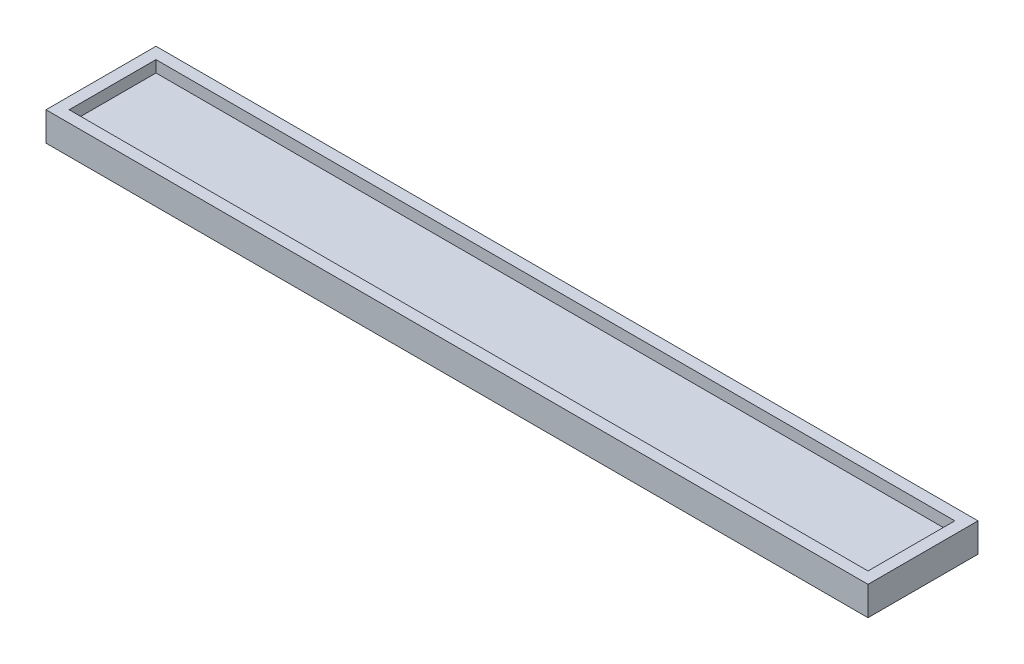
ISO-10303-21;
HEADER;
FILE_DESCRIPTION(('STEP AP214'),'2;1');
FILE_NAME('part.step','',(''),(''),'','','');
FILE_SCHEMA(('AUTOMOTIVE_DESIGN { 1 0 10303 214 1 1 1 1 }'));
ENDSEC;
DATA;
#1=APPLICATION_CONTEXT('core data for automotive mechanical design processes');
#2=APPLICATION_PROTOCOL_DEFINITION('international standard','automotive_design',2000,#1);
#3=PRODUCT_CONTEXT('',#1,'mechanical');
#4=PRODUCT('Part','Part','',(#3));
#5=PRODUCT_RELATED_PRODUCT_CATEGORY('part','',(#4));
#6=PRODUCT_DEFINITION_FORMATION('','',#4);
#7=PRODUCT_DEFINITION_CONTEXT('part definition',#1,'design');
#8=PRODUCT_DEFINITION('design','',#6,#7);
#9=PRODUCT_DEFINITION_SHAPE('','',#8);
#10=(LENGTH_UNIT() NAMED_UNIT(*) SI_UNIT(.MILLI.,.METRE.));
#11=(NAMED_UNIT(*) PLANE_ANGLE_UNIT() SI_UNIT($,.RADIAN.));
#12=(NAMED_UNIT(*) SI_UNIT($,.STERADIAN.) SOLID_ANGLE_UNIT());
#13=UNCERTAINTY_MEASURE_WITH_UNIT(LENGTH_MEASURE(1.E-05),#10,'distance_accuracy_value','');
#14=(GEOMETRIC_REPRESENTATION_CONTEXT(3) GLOBAL_UNCERTAINTY_ASSIGNED_CONTEXT((#13)) GLOBAL_UNIT_ASSIGNED_CONTEXT((#10,
#11,#12)) REPRESENTATION_CONTEXT('',''));
#15=CARTESIAN_POINT('',(0.,0.,0.));
#16=DIRECTION('',(0.,0.,1.));
#17=DIRECTION('',(1.,0.,0.));
#18=AXIS2_PLACEMENT_3D('',#15,#16,#17);
#19=CARTESIAN_POINT('',(0.,3.,0.));
#20=DIRECTION('',(0.,-1.,0.));
#21=DIRECTION('',(0.,0.,-1.));
#22=AXIS2_PLACEMENT_3D('',#19,#20,#21);
#23=PLANE('',#22);
#24=DIRECTION('',(0.,0.,1.));
#25=VECTOR('',#24,1.);
#26=CARTESIAN_POINT('',(0.,3.,0.));
#27=LINE('',#26,#25);
#28=CARTESIAN_POINT('',(0.,3.,-15.));
#29=VERTEX_POINT('',#28);
#30=CARTESIAN_POINT('',(0.,3.,0.));
#31=VERTEX_POINT('',#30);
#32=EDGE_CURVE('E160',#29,#31,#27,.T.);
#33=ORIENTED_EDGE('',*,*,#32,.T.);
#34=DIRECTION('',(1.,0.,0.));
#35=VECTOR('',#34,1.);
#36=CARTESIAN_POINT('',(0.,3.,0.));
#37=LINE('',#36,#35);
#38=CARTESIAN_POINT('',(138.,3.,0.));
#39=VERTEX_POINT('',#38);
#40=EDGE_CURVE('E164',#31,#39,#37,.T.);
#41=ORIENTED_EDGE('',*,*,#40,.T.);
#42=DIRECTION('',(0.,0.,-1.));
#43=VECTOR('',#42,1.);
#44=CARTESIAN_POINT('',(138.,3.,0.));
#45=LINE('',#44,#43);
#46=CARTESIAN_POINT('',(138.,3.,-15.));
#47=VERTEX_POINT('',#46);
#48=EDGE_CURVE('E50',#39,#47,#45,.T.);
#49=ORIENTED_EDGE('',*,*,#48,.T.);
#50=DIRECTION('',(-1.,0.,0.));
#51=VECTOR('',#50,1.);
#52=CARTESIAN_POINT('',(0.,3.,-15.));
#53=LINE('',#52,#51);
#54=EDGE_CURVE('E12',#47,#29,#53,.T.);
#55=ORIENTED_EDGE('',*,*,#54,.T.);
#56=EDGE_LOOP('',(#33,#41,#49,#55));
#57=FACE_BOUND('',#56,.T.);
#58=ADVANCED_FACE('F41',(#57),#23,.F.);
#59=CARTESIAN_POINT('',(0.,150.265487818944,-15.));
#60=DIRECTION('',(0.,0.,-1.));
#61=DIRECTION('',(-1.,0.,0.));
#62=AXIS2_PLACEMENT_3D('',#59,#60,#61);
#63=PLANE('',#62);
#64=DIRECTION('',(0.,-1.,0.));
#65=VECTOR('',#64,1.);
#66=CARTESIAN_POINT('',(0.,150.265487818944,-15.));
#67=LINE('',#66,#65);
#68=CARTESIAN_POINT('',(0.,5.,-15.));
#69=VERTEX_POINT('',#68);
#70=EDGE_CURVE('E140',#69,#29,#67,.T.);
#71=ORIENTED_EDGE('',*,*,#70,.T.);
#72=ORIENTED_EDGE('',*,*,#54,.F.);
#73=DIRECTION('',(0.,-1.,0.));
#74=VECTOR('',#73,1.);
#75=CARTESIAN_POINT('',(138.,150.265487818944,-15.));
#76=LINE('',#75,#74);
#77=CARTESIAN_POINT('',(138.,5.,-15.));
#78=VERTEX_POINT('',#77);
#79=EDGE_CURVE('E177',#78,#47,#76,.T.);
#80=ORIENTED_EDGE('',*,*,#79,.F.);
#81=DIRECTION('',(-1.,0.,0.));
#82=VECTOR('',#81,1.);
#83=CARTESIAN_POINT('',(0.,5.,-15.));
#84=LINE('',#83,#82);
#85=EDGE_CURVE('E150',#78,#69,#84,.T.);
#86=ORIENTED_EDGE('',*,*,#85,.T.);
#87=EDGE_LOOP('',(#71,#72,#80,#86));
#88=FACE_BOUND('',#87,.T.);
#89=ADVANCED_FACE('F202',(#88),#63,.F.);
#90=CARTESIAN_POINT('',(138.,150.265487818944,0.));
#91=DIRECTION('',(1.,0.,0.));
#92=DIRECTION('',(0.,0.,-1.));
#93=AXIS2_PLACEMENT_3D('',#90,#91,#92);
#94=PLANE('',#93);
#95=ORIENTED_EDGE('',*,*,#79,.T.);
#96=ORIENTED_EDGE('',*,*,#48,.F.);
#97=DIRECTION('',(0.,-1.,0.));
#98=VECTOR('',#97,1.);
#99=CARTESIAN_POINT('',(138.,150.265487818944,0.));
#100=LINE('',#99,#98);
#101=CARTESIAN_POINT('',(138.,5.,0.));
#102=VERTEX_POINT('',#101);
#103=EDGE_CURVE('E137',#102,#39,#100,.T.);
#104=ORIENTED_EDGE('',*,*,#103,.F.);
#105=DIRECTION('',(0.,0.,-1.));
#106=VECTOR('',#105,1.);
#107=CARTESIAN_POINT('',(138.,5.,0.));
#108=LINE('',#107,#106);
#109=EDGE_CURVE('E195',#102,#78,#108,.T.);
#110=ORIENTED_EDGE('',*,*,#109,.T.);
#111=EDGE_LOOP('',(#95,#96,#104,#110));
#112=FACE_BOUND('',#111,.T.);
#113=ADVANCED_FACE('F174',(#112),#94,.F.);
#114=CARTESIAN_POINT('',(0.,150.265487818944,0.));
#115=DIRECTION('',(0.,0.,1.));
#116=DIRECTION('',(1.,0.,0.));
#117=AXIS2_PLACEMENT_3D('',#114,#115,#116);
#118=PLANE('',#117);
#119=ORIENTED_EDGE('',*,*,#103,.T.);
#120=ORIENTED_EDGE('',*,*,#40,.F.);
#121=DIRECTION('',(0.,-1.,0.));
#122=VECTOR('',#121,1.);
#123=CARTESIAN_POINT('',(0.,150.265487818944,0.));
#124=LINE('',#123,#122);
#125=CARTESIAN_POINT('',(0.,5.,0.));
#126=VERTEX_POINT('',#125);
#127=EDGE_CURVE('E57',#126,#31,#124,.T.);
#128=ORIENTED_EDGE('',*,*,#127,.F.);
#129=DIRECTION('',(1.,0.,0.));
#130=VECTOR('',#129,1.);
#131=CARTESIAN_POINT('',(0.,5.,0.));
#132=LINE('',#131,#130);
#133=EDGE_CURVE('E180',#126,#102,#132,.T.);
#134=ORIENTED_EDGE('',*,*,#133,.T.);
#135=EDGE_LOOP('',(#119,#120,#128,#134));
#136=FACE_BOUND('',#135,.T.);
#137=ADVANCED_FACE('F179',(#136),#118,.F.);
#138=CARTESIAN_POINT('',(0.,150.265487818944,0.));
#139=DIRECTION('',(-1.,0.,0.));
#140=DIRECTION('',(0.,0.,1.));
#141=AXIS2_PLACEMENT_3D('',#138,#139,#140);
#142=PLANE('',#141);
#143=ORIENTED_EDGE('',*,*,#127,.T.);
#144=ORIENTED_EDGE('',*,*,#32,.F.);
#145=ORIENTED_EDGE('',*,*,#70,.F.);
#146=DIRECTION('',(0.,0.,1.));
#147=VECTOR('',#146,1.);
#148=CARTESIAN_POINT('',(0.,5.,0.));
#149=LINE('',#148,#147);
#150=EDGE_CURVE('E187',#69,#126,#149,.T.);
#151=ORIENTED_EDGE('',*,*,#150,.T.);
#152=EDGE_LOOP('',(#143,#144,#145,#151));
#153=FACE_BOUND('',#152,.T.);
#154=ADVANCED_FACE('F205',(#153),#142,.F.);
#155=CARTESIAN_POINT('',(-2.,150.265487818944,2.));
#156=DIRECTION('',(-1.,0.,0.));
#157=DIRECTION('',(0.,0.,1.));
#158=AXIS2_PLACEMENT_3D('',#155,#156,#157);
#159=PLANE('',#158);
#160=DIRECTION('',(0.,0.,1.));
#161=VECTOR('',#160,1.);
#162=CARTESIAN_POINT('',(-2.,5.,2.));
#163=LINE('',#162,#161);
#164=CARTESIAN_POINT('',(-2.,5.,-17.));
#165=VERTEX_POINT('',#164);
#166=CARTESIAN_POINT('',(-2.,5.,2.));
#167=VERTEX_POINT('',#166);
#168=EDGE_CURVE('E165',#165,#167,#163,.T.);
#169=ORIENTED_EDGE('',*,*,#168,.F.);
#170=DIRECTION('',(0.,-1.,0.));
#171=VECTOR('',#170,1.);
#172=CARTESIAN_POINT('',(-2.,150.265487818944,-17.));
#173=LINE('',#172,#171);
#174=CARTESIAN_POINT('',(-2.,0.,-17.));
#175=VERTEX_POINT('',#174);
#176=EDGE_CURVE('E120',#165,#175,#173,.T.);
#177=ORIENTED_EDGE('',*,*,#176,.T.);
#178=DIRECTION('',(0.,0.,-1.));
#179=VECTOR('',#178,1.);
#180=CARTESIAN_POINT('',(-2.,0.,2.));
#181=LINE('',#180,#179);
#182=CARTESIAN_POINT('',(-2.,0.,2.));
#183=VERTEX_POINT('',#182);
#184=EDGE_CURVE('E124',#183,#175,#181,.T.);
#185=ORIENTED_EDGE('',*,*,#184,.F.);
#186=DIRECTION('',(0.,-1.,0.));
#187=VECTOR('',#186,1.);
#188=CARTESIAN_POINT('',(-2.,150.265487818944,2.));
#189=LINE('',#188,#187);
#190=EDGE_CURVE('E109',#167,#183,#189,.T.);
#191=ORIENTED_EDGE('',*,*,#190,.F.);
#192=EDGE_LOOP('',(#169,#177,#185,#191));
#193=FACE_BOUND('',#192,.T.);
#194=ADVANCED_FACE('F125',(#193),#159,.T.);
#195=CARTESIAN_POINT('',(-2.,150.265487818944,-17.));
#196=DIRECTION('',(0.,0.,-1.));
#197=DIRECTION('',(-1.,0.,0.));
#198=AXIS2_PLACEMENT_3D('',#195,#196,#197);
#199=PLANE('',#198);
#200=DIRECTION('',(-1.,0.,0.));
#201=VECTOR('',#200,1.);
#202=CARTESIAN_POINT('',(-2.,5.,-17.));
#203=LINE('',#202,#201);
#204=CARTESIAN_POINT('',(140.,5.,-17.));
#205=VERTEX_POINT('',#204);
#206=EDGE_CURVE('E159',#205,#165,#203,.T.);
#207=ORIENTED_EDGE('',*,*,#206,.F.);
#208=DIRECTION('',(0.,-1.,0.));
#209=VECTOR('',#208,1.);
#210=CARTESIAN_POINT('',(140.,150.265487818944,-17.));
#211=LINE('',#210,#209);
#212=CARTESIAN_POINT('',(140.,0.,-17.));
#213=VERTEX_POINT('',#212);
#214=EDGE_CURVE('E151',#205,#213,#211,.T.);
#215=ORIENTED_EDGE('',*,*,#214,.T.);
#216=DIRECTION('',(1.,0.,0.));
#217=VECTOR('',#216,1.);
#218=CARTESIAN_POINT('',(-2.,0.,-17.));
#219=LINE('',#218,#217);
#220=EDGE_CURVE('E131',#175,#213,#219,.T.);
#221=ORIENTED_EDGE('',*,*,#220,.F.);
#222=ORIENTED_EDGE('',*,*,#176,.F.);
#223=EDGE_LOOP('',(#207,#215,#221,#222));
#224=FACE_BOUND('',#223,.T.);
#225=ADVANCED_FACE('F213',(#224),#199,.T.);
#226=CARTESIAN_POINT('',(140.,150.265487818944,2.));
#227=DIRECTION('',(1.,0.,0.));
#228=DIRECTION('',(0.,0.,-1.));
#229=AXIS2_PLACEMENT_3D('',#226,#227,#228);
#230=PLANE('',#229);
#231=DIRECTION('',(0.,0.,-1.));
#232=VECTOR('',#231,1.);
#233=CARTESIAN_POINT('',(140.,5.,2.));
#234=LINE('',#233,#232);
#235=CARTESIAN_POINT('',(140.,5.,2.));
#236=VERTEX_POINT('',#235);
#237=EDGE_CURVE('E188',#236,#205,#234,.T.);
#238=ORIENTED_EDGE('',*,*,#237,.F.);
#239=DIRECTION('',(0.,-1.,0.));
#240=VECTOR('',#239,1.);
#241=CARTESIAN_POINT('',(140.,150.265487818944,2.));
#242=LINE('',#241,#240);
#243=CARTESIAN_POINT('',(140.,0.,2.));
#244=VERTEX_POINT('',#243);
#245=EDGE_CURVE('E147',#236,#244,#242,.T.);
#246=ORIENTED_EDGE('',*,*,#245,.T.);
#247=DIRECTION('',(0.,0.,1.));
#248=VECTOR('',#247,1.);
#249=CARTESIAN_POINT('',(140.,0.,2.));
#250=LINE('',#249,#248);
#251=EDGE_CURVE('E121',#213,#244,#250,.T.);
#252=ORIENTED_EDGE('',*,*,#251,.F.);
#253=ORIENTED_EDGE('',*,*,#214,.F.);
#254=EDGE_LOOP('',(#238,#246,#252,#253));
#255=FACE_BOUND('',#254,.T.);
#256=ADVANCED_FACE('F224',(#255),#230,.T.);
#257=CARTESIAN_POINT('',(-2.,150.265487818944,2.));
#258=DIRECTION('',(0.,0.,1.));
#259=DIRECTION('',(1.,0.,0.));
#260=AXIS2_PLACEMENT_3D('',#257,#258,#259);
#261=PLANE('',#260);
#262=DIRECTION('',(1.,0.,0.));
#263=VECTOR('',#262,1.);
#264=CARTESIAN_POINT('',(-2.,5.,2.));
#265=LINE('',#264,#263);
#266=EDGE_CURVE('E116',#167,#236,#265,.T.);
#267=ORIENTED_EDGE('',*,*,#266,.F.);
#268=ORIENTED_EDGE('',*,*,#190,.T.);
#269=DIRECTION('',(-1.,0.,0.));
#270=VECTOR('',#269,1.);
#271=CARTESIAN_POINT('',(-2.,0.,2.));
#272=LINE('',#271,#270);
#273=EDGE_CURVE('E114',#244,#183,#272,.T.);
#274=ORIENTED_EDGE('',*,*,#273,.F.);
#275=ORIENTED_EDGE('',*,*,#245,.F.);
#276=EDGE_LOOP('',(#267,#268,#274,#275));
#277=FACE_BOUND('',#276,.T.);
#278=ADVANCED_FACE('F111',(#277),#261,.T.);
#279=CARTESIAN_POINT('',(0.,5.,0.));
#280=DIRECTION('',(0.,-1.,0.));
#281=DIRECTION('',(0.,0.,-1.));
#282=AXIS2_PLACEMENT_3D('',#279,#280,#281);
#283=PLANE('',#282);
#284=ORIENTED_EDGE('',*,*,#266,.T.);
#285=ORIENTED_EDGE('',*,*,#237,.T.);
#286=ORIENTED_EDGE('',*,*,#206,.T.);
#287=ORIENTED_EDGE('',*,*,#168,.T.);
#288=EDGE_LOOP('',(#284,#285,#286,#287));
#289=FACE_BOUND('',#288,.T.);
#290=ORIENTED_EDGE('',*,*,#85,.F.);
#291=ORIENTED_EDGE('',*,*,#109,.F.);
#292=ORIENTED_EDGE('',*,*,#133,.F.);
#293=ORIENTED_EDGE('',*,*,#150,.F.);
#294=EDGE_LOOP('',(#290,#291,#292,#293));
#295=FACE_BOUND('',#294,.T.);
#296=ADVANCED_FACE('F204',(#289,#295),#283,.F.);
#297=CARTESIAN_POINT('',(0.,0.,0.));
#298=DIRECTION('',(0.,-1.,0.));
#299=DIRECTION('',(0.,0.,-1.));
#300=AXIS2_PLACEMENT_3D('',#297,#298,#299);
#301=PLANE('',#300);
#302=ORIENTED_EDGE('',*,*,#273,.T.);
#303=ORIENTED_EDGE('',*,*,#184,.T.);
#304=ORIENTED_EDGE('',*,*,#220,.T.);
#305=ORIENTED_EDGE('',*,*,#251,.T.);
#306=EDGE_LOOP('',(#302,#303,#304,#305));
#307=FACE_BOUND('',#306,.T.);
#308=ADVANCED_FACE('F43',(#307),#301,.T.);
#309=CLOSED_SHELL('',(#58,#89,#113,#137,#154,#194,#225,#256,#278,#296,#308));
#310=MANIFOLD_SOLID_BREP('B2',#309);
#311=ADVANCED_BREP_SHAPE_REPRESENTATION('',(#18,#310),#14);
#312=SHAPE_DEFINITION_REPRESENTATION(#9,#311);
ENDSEC;
END-ISO-10303-21;
